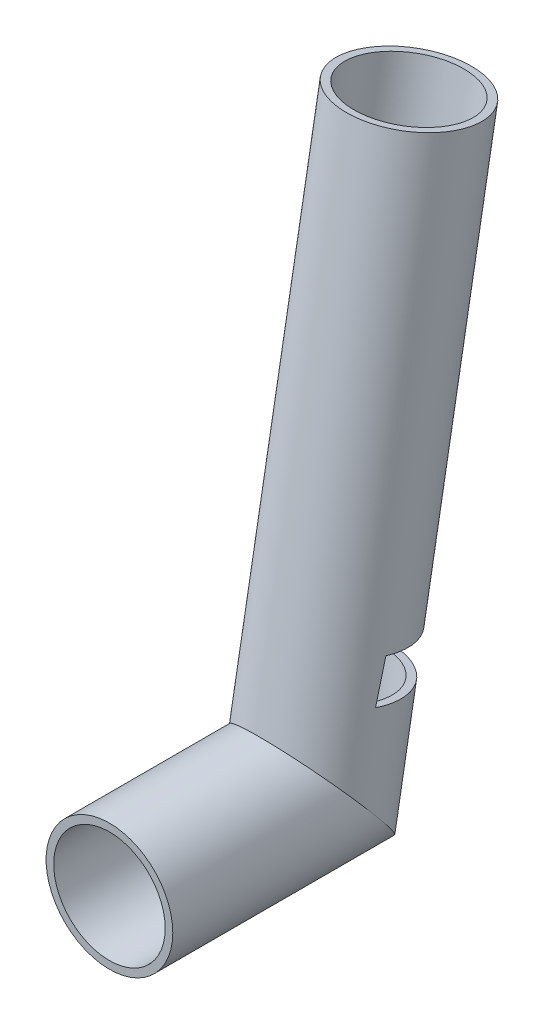
ISO-10303-21;
HEADER;
FILE_DESCRIPTION(('STEP AP214'),'2;1');
FILE_NAME('part.step','',(''),(''),'','','');
FILE_SCHEMA(('AUTOMOTIVE_DESIGN { 1 0 10303 214 1 1 1 1 }'));
ENDSEC;
DATA;
#1=APPLICATION_CONTEXT('core data for automotive mechanical design processes');
#2=APPLICATION_PROTOCOL_DEFINITION('international standard','automotive_design',2000,#1);
#3=PRODUCT_CONTEXT('',#1,'mechanical');
#4=PRODUCT('Part','Part','',(#3));
#5=PRODUCT_RELATED_PRODUCT_CATEGORY('part','',(#4));
#6=PRODUCT_DEFINITION_FORMATION('','',#4);
#7=PRODUCT_DEFINITION_CONTEXT('part definition',#1,'design');
#8=PRODUCT_DEFINITION('design','',#6,#7);
#9=PRODUCT_DEFINITION_SHAPE('','',#8);
#10=(LENGTH_UNIT() NAMED_UNIT(*) SI_UNIT(.MILLI.,.METRE.));
#11=(NAMED_UNIT(*) PLANE_ANGLE_UNIT() SI_UNIT($,.RADIAN.));
#12=(NAMED_UNIT(*) SI_UNIT($,.STERADIAN.) SOLID_ANGLE_UNIT());
#13=UNCERTAINTY_MEASURE_WITH_UNIT(LENGTH_MEASURE(1.E-05),#10,'distance_accuracy_value','');
#14=(GEOMETRIC_REPRESENTATION_CONTEXT(3) GLOBAL_UNCERTAINTY_ASSIGNED_CONTEXT((#13)) GLOBAL_UNIT_ASSIGNED_CONTEXT((#10,
#11,#12)) REPRESENTATION_CONTEXT('',''));
#15=CARTESIAN_POINT('',(0.,0.,0.));
#16=DIRECTION('',(0.,0.,1.));
#17=DIRECTION('',(1.,0.,0.));
#18=AXIS2_PLACEMENT_3D('',#15,#16,#17);
#19=CARTESIAN_POINT('',(0.,-40.0939089762223,-72.9303620854231));
#20=DIRECTION('',(0.,0.98480775301221,-0.17364817766692));
#21=DIRECTION('',(0.,0.17364817766692,0.98480775301221));
#22=AXIS2_PLACEMENT_3D('',#19,#20,#21);
#23=CYLINDRICAL_SURFACE('',#22,22.);
#24=CARTESIAN_POINT('',(0.,216.657705662686,-118.202599086723));
#25=DIRECTION('',(0.,-0.98480775301221,0.17364817766692));
#26=DIRECTION('',(1.,0.,0.));
#27=AXIS2_PLACEMENT_3D('',#24,#25,#26);
#28=CIRCLE('',#27,22.);
#29=CARTESIAN_POINT('',(22.,216.657705662686,-118.202599086723));
#30=VERTEX_POINT('',#29);
#31=EDGE_CURVE('E102',#30,#30,#28,.F.);
#32=ORIENTED_EDGE('',*,*,#31,.T.);
#33=EDGE_LOOP('',(#32));
#34=FACE_BOUND('',#33,.T.);
#35=CARTESIAN_POINT('',(0.,0.,-80.));
#36=DIRECTION('',(0.,0.642787609686543,-0.766044443118975));
#37=DIRECTION('',(0.,-0.766044443118975,-0.642787609686543));
#38=AXIS2_PLACEMENT_3D('',#35,#36,#37);
#39=ELLIPSE('',#38,28.7189603653102,22.);
#40=CARTESIAN_POINT('',(0.,-22.,-98.4601918859004));
#41=VERTEX_POINT('',#40);
#42=EDGE_CURVE('E90',#41,#41,#39,.F.);
#43=ORIENTED_EDGE('',*,*,#42,.T.);
#44=EDGE_LOOP('',(#43));
#45=FACE_BOUND('',#44,.T.);
#46=CARTESIAN_POINT('',(0.,122.72140743661,-101.63909524159));
#47=DIRECTION('',(0.,-0.235906352108225,-0.971775793604157));
#48=DIRECTION('',(0.,0.971775793604158,-0.235906352108225));
#49=AXIS2_PLACEMENT_3D('',#46,#47,#48);
#50=ELLIPSE('',#49,346.046293557793,22.);
#51=CARTESIAN_POINT('',(-21.511110706218,52.2224091574978,-84.5248991268385));
#52=VERTEX_POINT('',#51);
#53=CARTESIAN_POINT('',(-21.2605618337633,36.2694945527524,-80.6522014174814));
#54=VERTEX_POINT('',#53);
#55=EDGE_CURVE('E11',#52,#54,#50,.F.);
#56=ORIENTED_EDGE('',*,*,#55,.F.);
#57=CARTESIAN_POINT('',(0.,51.4215141651784,-89.067000336203));
#58=DIRECTION('',(0.,0.98480775301221,-0.17364817766692));
#59=DIRECTION('',(0.,0.17364817766692,0.98480775301221));
#60=AXIS2_PLACEMENT_3D('',#57,#58,#59);
#61=CIRCLE('',#60,22.);
#62=CARTESIAN_POINT('',(21.511110706218,52.2224091574978,-84.5248991268385));
#63=VERTEX_POINT('',#62);
#64=EDGE_CURVE('E37',#52,#63,#61,.F.);
#65=ORIENTED_EDGE('',*,*,#64,.T.);
#66=CARTESIAN_POINT('',(21.2605618337632,36.2694945527524,-80.6522014174814));
#67=VERTEX_POINT('',#66);
#68=EDGE_CURVE('E43',#67,#63,#50,.F.);
#69=ORIENTED_EDGE('',*,*,#68,.F.);
#70=CARTESIAN_POINT('',(0.,35.2873684829464,-86.2221151417447));
#71=DIRECTION('',(0.,-0.98480775301221,0.17364817766692));
#72=DIRECTION('',(0.,-0.17364817766692,-0.98480775301221));
#73=AXIS2_PLACEMENT_3D('',#70,#71,#72);
#74=CIRCLE('',#73,22.);
#75=EDGE_CURVE('E86',#67,#54,#74,.F.);
#76=ORIENTED_EDGE('',*,*,#75,.T.);
#77=EDGE_LOOP('',(#56,#65,#69,#76));
#78=FACE_BOUND('',#77,.T.);
#79=ADVANCED_FACE('F33',(#34,#45,#78),#23,.F.);
#80=CARTESIAN_POINT('',(0.,-45.5478310036206,-71.9686884813127));
#81=DIRECTION('',(0.,0.98480775301221,-0.17364817766692));
#82=DIRECTION('',(0.,0.17364817766692,0.98480775301221));
#83=AXIS2_PLACEMENT_3D('',#80,#81,#82);
#84=CYLINDRICAL_SURFACE('',#83,25.);
#85=CARTESIAN_POINT('',(0.,122.72140743661,-101.63909524159));
#86=DIRECTION('',(0.,-0.235906352108225,-0.971775793604157));
#87=DIRECTION('',(0.,0.971775793604158,-0.235906352108225));
#88=AXIS2_PLACEMENT_3D('',#85,#86,#87);
#89=ELLIPSE('',#88,393.234424497492,25.);
#90=CARTESIAN_POINT('',(-24.3518272309753,36.2694945527524,-80.6522014174814));
#91=VERTEX_POINT('',#90);
#92=CARTESIAN_POINT('',(-24.5708747059434,52.2224091574978,-84.5248991268385));
#93=VERTEX_POINT('',#92);
#94=EDGE_CURVE('E88',#91,#93,#89,.T.);
#95=ORIENTED_EDGE('',*,*,#94,.F.);
#96=CARTESIAN_POINT('',(0.,35.2873684829465,-86.2221151417447));
#97=DIRECTION('',(0.,-0.98480775301221,0.17364817766692));
#98=DIRECTION('',(0.,-0.17364817766692,-0.98480775301221));
#99=AXIS2_PLACEMENT_3D('',#96,#97,#98);
#100=CIRCLE('',#99,25.);
#101=CARTESIAN_POINT('',(24.3518272309753,36.2694945527524,-80.6522014174814));
#102=VERTEX_POINT('',#101);
#103=EDGE_CURVE('E50',#91,#102,#100,.T.);
#104=ORIENTED_EDGE('',*,*,#103,.T.);
#105=CARTESIAN_POINT('',(24.5708747059433,52.2224091574978,-84.5248991268385));
#106=VERTEX_POINT('',#105);
#107=EDGE_CURVE('E112',#106,#102,#89,.T.);
#108=ORIENTED_EDGE('',*,*,#107,.F.);
#109=CARTESIAN_POINT('',(0.,51.4215141651783,-89.067000336203));
#110=DIRECTION('',(0.,0.98480775301221,-0.17364817766692));
#111=DIRECTION('',(0.,0.17364817766692,0.98480775301221));
#112=AXIS2_PLACEMENT_3D('',#109,#110,#111);
#113=CIRCLE('',#112,25.);
#114=EDGE_CURVE('E96',#106,#93,#113,.T.);
#115=ORIENTED_EDGE('',*,*,#114,.T.);
#116=EDGE_LOOP('',(#95,#104,#108,#115));
#117=FACE_BOUND('',#116,.T.);
#118=CARTESIAN_POINT('',(0.,0.,-80.));
#119=DIRECTION('',(0.,0.642787609686543,-0.766044443118975));
#120=DIRECTION('',(0.,-0.766044443118975,-0.642787609686543));
#121=AXIS2_PLACEMENT_3D('',#118,#119,#120);
#122=ELLIPSE('',#121,32.6351822333071,25.);
#123=CARTESIAN_POINT('',(0.,-25.,-100.977490779432));
#124=VERTEX_POINT('',#123);
#125=EDGE_CURVE('E92',#124,#124,#122,.T.);
#126=ORIENTED_EDGE('',*,*,#125,.T.);
#127=EDGE_LOOP('',(#126));
#128=FACE_BOUND('',#127,.T.);
#129=CARTESIAN_POINT('',(0.,216.657705662686,-118.202599086723));
#130=DIRECTION('',(0.,-0.98480775301221,0.17364817766692));
#131=DIRECTION('',(1.,0.,0.));
#132=AXIS2_PLACEMENT_3D('',#129,#130,#131);
#133=CIRCLE('',#132,25.);
#134=CARTESIAN_POINT('',(25.,216.657705662686,-118.202599086723));
#135=VERTEX_POINT('',#134);
#136=EDGE_CURVE('E95',#135,#135,#133,.T.);
#137=ORIENTED_EDGE('',*,*,#136,.T.);
#138=EDGE_LOOP('',(#137));
#139=FACE_BOUND('',#138,.T.);
#140=ADVANCED_FACE('F35',(#117,#128,#139),#84,.T.);
#141=CARTESIAN_POINT('',(0.,0.,0.));
#142=DIRECTION('',(0.,0.,-1.));
#143=DIRECTION('',(-1.,0.,0.));
#144=AXIS2_PLACEMENT_3D('',#141,#142,#143);
#145=CYLINDRICAL_SURFACE('',#144,25.);
#146=CARTESIAN_POINT('',(0.,0.,0.));
#147=DIRECTION('',(0.,0.,1.));
#148=DIRECTION('',(1.,0.,0.));
#149=AXIS2_PLACEMENT_3D('',#146,#147,#148);
#150=CIRCLE('',#149,25.);
#151=CARTESIAN_POINT('',(25.,0.,0.));
#152=VERTEX_POINT('',#151);
#153=EDGE_CURVE('E99',#152,#152,#150,.T.);
#154=ORIENTED_EDGE('',*,*,#153,.F.);
#155=EDGE_LOOP('',(#154));
#156=FACE_BOUND('',#155,.T.);
#157=ORIENTED_EDGE('',*,*,#125,.F.);
#158=EDGE_LOOP('',(#157));
#159=FACE_BOUND('',#158,.T.);
#160=ADVANCED_FACE('F136',(#156,#159),#145,.T.);
#161=CARTESIAN_POINT('',(0.,216.657705662686,-118.202599086723));
#162=DIRECTION('',(0.,-0.98480775301221,0.17364817766692));
#163=DIRECTION('',(1.,0.,0.));
#164=AXIS2_PLACEMENT_3D('',#161,#162,#163);
#165=PLANE('',#164);
#166=ORIENTED_EDGE('',*,*,#31,.F.);
#167=EDGE_LOOP('',(#166));
#168=FACE_BOUND('',#167,.T.);
#169=ORIENTED_EDGE('',*,*,#136,.F.);
#170=EDGE_LOOP('',(#169));
#171=FACE_BOUND('',#170,.T.);
#172=ADVANCED_FACE('F146',(#168,#171),#165,.F.);
#173=CARTESIAN_POINT('',(0.,0.,0.));
#174=DIRECTION('',(0.,0.,1.));
#175=DIRECTION('',(1.,0.,0.));
#176=AXIS2_PLACEMENT_3D('',#173,#174,#175);
#177=PLANE('',#176);
#178=CARTESIAN_POINT('',(0.,0.,0.));
#179=DIRECTION('',(0.,0.,1.));
#180=DIRECTION('',(1.,0.,0.));
#181=AXIS2_PLACEMENT_3D('',#178,#179,#180);
#182=CIRCLE('',#181,22.);
#183=CARTESIAN_POINT('',(22.,0.,0.));
#184=VERTEX_POINT('',#183);
#185=EDGE_CURVE('E105',#184,#184,#182,.F.);
#186=ORIENTED_EDGE('',*,*,#185,.T.);
#187=EDGE_LOOP('',(#186));
#188=FACE_BOUND('',#187,.T.);
#189=ORIENTED_EDGE('',*,*,#153,.T.);
#190=EDGE_LOOP('',(#189));
#191=FACE_BOUND('',#190,.T.);
#192=ADVANCED_FACE('F131',(#188,#191),#177,.T.);
#193=CARTESIAN_POINT('',(0.,0.,0.));
#194=DIRECTION('',(0.,0.,-1.));
#195=DIRECTION('',(-1.,0.,0.));
#196=AXIS2_PLACEMENT_3D('',#193,#194,#195);
#197=CYLINDRICAL_SURFACE('',#196,22.);
#198=ORIENTED_EDGE('',*,*,#185,.F.);
#199=EDGE_LOOP('',(#198));
#200=FACE_BOUND('',#199,.T.);
#201=ORIENTED_EDGE('',*,*,#42,.F.);
#202=EDGE_LOOP('',(#201));
#203=FACE_BOUND('',#202,.T.);
#204=ADVANCED_FACE('F124',(#200,#203),#197,.F.);
#205=CARTESIAN_POINT('',(-25.,65.1023198982043,-11.4792955047663));
#206=DIRECTION('',(0.,0.98480775301221,-0.17364817766692));
#207=DIRECTION('',(0.,0.17364817766692,0.98480775301221));
#208=AXIS2_PLACEMENT_3D('',#205,#206,#207);
#209=PLANE('',#208);
#210=DIRECTION('',(1.,0.,0.));
#211=VECTOR('',#210,1.);
#212=CARTESIAN_POINT('',(-25.,52.2224091574978,-84.5248991268385));
#213=LINE('',#212,#211);
#214=EDGE_CURVE('E114',#63,#106,#213,.T.);
#215=ORIENTED_EDGE('',*,*,#214,.F.);
#216=ORIENTED_EDGE('',*,*,#64,.F.);
#217=EDGE_CURVE('E81',#93,#52,#213,.T.);
#218=ORIENTED_EDGE('',*,*,#217,.F.);
#219=ORIENTED_EDGE('',*,*,#114,.F.);
#220=EDGE_LOOP('',(#215,#216,#218,#219));
#221=FACE_BOUND('',#220,.T.);
#222=ADVANCED_FACE('F122',(#221),#209,.F.);
#223=CARTESIAN_POINT('',(-25.,48.9681742159724,-8.63441031030798));
#224=DIRECTION('',(0.,-0.98480775301221,0.17364817766692));
#225=DIRECTION('',(0.,-0.17364817766692,-0.98480775301221));
#226=AXIS2_PLACEMENT_3D('',#223,#224,#225);
#227=PLANE('',#226);
#228=ORIENTED_EDGE('',*,*,#103,.F.);
#229=DIRECTION('',(1.,0.,0.));
#230=VECTOR('',#229,1.);
#231=CARTESIAN_POINT('',(-25.,36.2694945527524,-80.6522014174814));
#232=LINE('',#231,#230);
#233=EDGE_CURVE('E78',#91,#54,#232,.T.);
#234=ORIENTED_EDGE('',*,*,#233,.T.);
#235=ORIENTED_EDGE('',*,*,#75,.F.);
#236=EDGE_CURVE('E57',#67,#102,#232,.T.);
#237=ORIENTED_EDGE('',*,*,#236,.T.);
#238=EDGE_LOOP('',(#228,#234,#235,#237));
#239=FACE_BOUND('',#238,.T.);
#240=ADVANCED_FACE('F85',(#239),#227,.F.);
#241=CARTESIAN_POINT('',(-25.,-16.4708996177153,-67.8490485921158));
#242=DIRECTION('',(0.,-0.235906352108225,-0.971775793604157));
#243=DIRECTION('',(0.,0.971775793604158,-0.235906352108225));
#244=AXIS2_PLACEMENT_3D('',#241,#242,#243);
#245=PLANE('',#244);
#246=ORIENTED_EDGE('',*,*,#107,.T.);
#247=ORIENTED_EDGE('',*,*,#236,.F.);
#248=ORIENTED_EDGE('',*,*,#68,.T.);
#249=ORIENTED_EDGE('',*,*,#214,.T.);
#250=EDGE_LOOP('',(#246,#247,#248,#249));
#251=FACE_BOUND('',#250,.T.);
#252=ADVANCED_FACE('F118',(#251),#245,.T.);
#253=ORIENTED_EDGE('',*,*,#94,.T.);
#254=ORIENTED_EDGE('',*,*,#217,.T.);
#255=ORIENTED_EDGE('',*,*,#55,.T.);
#256=ORIENTED_EDGE('',*,*,#233,.F.);
#257=EDGE_LOOP('',(#253,#254,#255,#256));
#258=FACE_BOUND('',#257,.T.);
#259=ADVANCED_FACE('F77',(#258),#245,.T.);
#260=CLOSED_SHELL('',(#79,#140,#160,#172,#192,#204,#222,#240,#252,#259));
#261=MANIFOLD_SOLID_BREP('B2',#260);
#262=ADVANCED_BREP_SHAPE_REPRESENTATION('',(#18,#261),#14);
#263=SHAPE_DEFINITION_REPRESENTATION(#9,#262);
ENDSEC;
END-ISO-10303-21;
